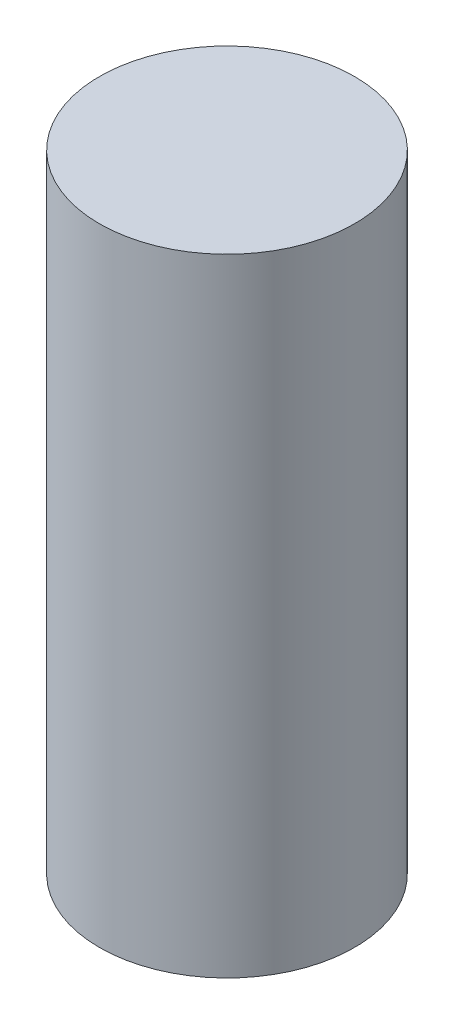
ISO-10303-21;
HEADER;
FILE_DESCRIPTION(('STEP AP214'),'2;1');
FILE_NAME('part.step','',(''),(''),'','','');
FILE_SCHEMA(('AUTOMOTIVE_DESIGN { 1 0 10303 214 1 1 1 1 }'));
ENDSEC;
DATA;
#1=APPLICATION_CONTEXT('core data for automotive mechanical design processes');
#2=APPLICATION_PROTOCOL_DEFINITION('international standard','automotive_design',2000,#1);
#3=PRODUCT_CONTEXT('',#1,'mechanical');
#4=PRODUCT('Part','Part','',(#3));
#5=PRODUCT_RELATED_PRODUCT_CATEGORY('part','',(#4));
#6=PRODUCT_DEFINITION_FORMATION('','',#4);
#7=PRODUCT_DEFINITION_CONTEXT('part definition',#1,'design');
#8=PRODUCT_DEFINITION('design','',#6,#7);
#9=PRODUCT_DEFINITION_SHAPE('','',#8);
#10=(LENGTH_UNIT() NAMED_UNIT(*) SI_UNIT(.MILLI.,.METRE.));
#11=(NAMED_UNIT(*) PLANE_ANGLE_UNIT() SI_UNIT($,.RADIAN.));
#12=(NAMED_UNIT(*) SI_UNIT($,.STERADIAN.) SOLID_ANGLE_UNIT());
#13=UNCERTAINTY_MEASURE_WITH_UNIT(LENGTH_MEASURE(1.E-05),#10,'distance_accuracy_value','');
#14=(GEOMETRIC_REPRESENTATION_CONTEXT(3) GLOBAL_UNCERTAINTY_ASSIGNED_CONTEXT((#13)) GLOBAL_UNIT_ASSIGNED_CONTEXT((#10,
#11,#12)) REPRESENTATION_CONTEXT('',''));
#15=CARTESIAN_POINT('',(0.,0.,0.));
#16=DIRECTION('',(0.,0.,1.));
#17=DIRECTION('',(1.,0.,0.));
#18=AXIS2_PLACEMENT_3D('',#15,#16,#17);
#19=CARTESIAN_POINT('',(-20.4825887636145,12.2364464109381,79.5198251851226));
#20=DIRECTION('',(0.,-1.,0.));
#21=DIRECTION('',(-0.0616130136495363,0.,-0.998100113490136));
#22=AXIS2_PLACEMENT_3D('',#19,#20,#21);
#23=PLANE('',#22);
#24=CARTESIAN_POINT('',(0.,12.2364464109381,0.));
#25=DIRECTION('',(0.,-1.,0.));
#26=DIRECTION('',(0.,0.,-1.));
#27=AXIS2_PLACEMENT_3D('',#24,#25,#26);
#28=CIRCLE('',#27,6.35);
#29=CARTESIAN_POINT('',(0.,12.2364464109381,-6.35));
#30=VERTEX_POINT('',#29);
#31=EDGE_CURVE('E10',#30,#30,#28,.T.);
#32=ORIENTED_EDGE('',*,*,#31,.F.);
#33=EDGE_LOOP('',(#32));
#34=FACE_BOUND('',#33,.T.);
#35=ADVANCED_FACE('F31',(#34),#23,.F.);
#36=CARTESIAN_POINT('',(0.,30.1969586530764,0.));
#37=DIRECTION('',(0.,-1.,0.));
#38=DIRECTION('',(0.,0.,-1.));
#39=AXIS2_PLACEMENT_3D('',#36,#37,#38);
#40=CYLINDRICAL_SURFACE('',#39,6.35);
#41=CARTESIAN_POINT('',(0.,-18.9635535890619,0.));
#42=DIRECTION('',(0.,-1.,0.));
#43=DIRECTION('',(0.,0.,-1.));
#44=AXIS2_PLACEMENT_3D('',#41,#42,#43);
#45=CIRCLE('',#44,6.35);
#46=CARTESIAN_POINT('',(0.,-18.9635535890619,-6.35));
#47=VERTEX_POINT('',#46);
#48=EDGE_CURVE('E37',#47,#47,#45,.F.);
#49=CARTESIAN_POINT('',(0.,12.2364464109381,-6.35));
#50=CARTESIAN_POINT('',(0.,11.9114464109381,-6.35));
#51=CARTESIAN_POINT('',(0.,11.5864464109381,-6.35));
#52=CARTESIAN_POINT('',(0.,10.9364464109381,-6.35));
#53=CARTESIAN_POINT('',(0.,10.6114464109381,-6.35));
#54=CARTESIAN_POINT('',(0.,9.96144641093806,-6.35));
#55=CARTESIAN_POINT('',(0.,9.63644641093807,-6.35));
#56=CARTESIAN_POINT('',(0.,8.98644641093806,-6.35));
#57=CARTESIAN_POINT('',(0.,8.66144641093807,-6.35));
#58=CARTESIAN_POINT('',(0.,8.01144641093807,-6.35));
#59=CARTESIAN_POINT('',(0.,7.68644641093807,-6.35));
#60=CARTESIAN_POINT('',(0.,7.03644641093807,-6.35));
#61=CARTESIAN_POINT('',(0.,6.71144641093807,-6.35));
#62=CARTESIAN_POINT('',(0.,6.06144641093807,-6.35));
#63=CARTESIAN_POINT('',(0.,5.73644641093807,-6.35));
#64=CARTESIAN_POINT('',(0.,5.08644641093807,-6.35));
#65=CARTESIAN_POINT('',(0.,4.76144641093807,-6.35));
#66=CARTESIAN_POINT('',(0.,4.11144641093807,-6.35));
#67=CARTESIAN_POINT('',(0.,3.78644641093807,-6.35));
#68=CARTESIAN_POINT('',(0.,3.13644641093807,-6.35));
#69=CARTESIAN_POINT('',(0.,2.81144641093807,-6.35));
#70=CARTESIAN_POINT('',(0.,2.16144641093807,-6.35));
#71=CARTESIAN_POINT('',(0.,1.83644641093807,-6.35));
#72=CARTESIAN_POINT('',(0.,1.18644641093807,-6.35));
#73=CARTESIAN_POINT('',(0.,0.861446410938074,-6.35));
#74=CARTESIAN_POINT('',(0.,0.211446410938075,-6.35));
#75=CARTESIAN_POINT('',(0.,-0.113553589061925,-6.35));
#76=CARTESIAN_POINT('',(0.,-0.763553589061924,-6.35));
#77=CARTESIAN_POINT('',(0.,-1.08855358906192,-6.35));
#78=CARTESIAN_POINT('',(0.,-1.73855358906192,-6.35));
#79=CARTESIAN_POINT('',(0.,-2.06355358906192,-6.35));
#80=CARTESIAN_POINT('',(0.,-2.71355358906192,-6.35));
#81=CARTESIAN_POINT('',(0.,-3.03855358906192,-6.35));
#82=CARTESIAN_POINT('',(0.,-3.68855358906192,-6.35));
#83=CARTESIAN_POINT('',(0.,-4.01355358906192,-6.35));
#84=CARTESIAN_POINT('',(0.,-4.66355358906192,-6.35));
#85=CARTESIAN_POINT('',(0.,-4.98855358906192,-6.35));
#86=CARTESIAN_POINT('',(0.,-5.63855358906191,-6.35));
#87=CARTESIAN_POINT('',(0.,-5.96355358906191,-6.35));
#88=CARTESIAN_POINT('',(0.,-6.61355358906191,-6.35));
#89=CARTESIAN_POINT('',(0.,-6.93855358906191,-6.35));
#90=CARTESIAN_POINT('',(0.,-7.58855358906191,-6.35));
#91=CARTESIAN_POINT('',(0.,-7.91355358906191,-6.35));
#92=CARTESIAN_POINT('',(0.,-8.56355358906191,-6.35));
#93=CARTESIAN_POINT('',(0.,-8.88855358906191,-6.35));
#94=CARTESIAN_POINT('',(0.,-9.53855358906191,-6.35));
#95=CARTESIAN_POINT('',(0.,-9.86355358906191,-6.35));
#96=CARTESIAN_POINT('',(0.,-10.5135535890619,-6.35));
#97=CARTESIAN_POINT('',(0.,-10.8385535890619,-6.35));
#98=CARTESIAN_POINT('',(0.,-11.4885535890619,-6.35));
#99=CARTESIAN_POINT('',(0.,-11.8135535890619,-6.35));
#100=CARTESIAN_POINT('',(0.,-12.4635535890619,-6.35));
#101=CARTESIAN_POINT('',(0.,-12.7885535890619,-6.35));
#102=CARTESIAN_POINT('',(0.,-13.4385535890619,-6.35));
#103=CARTESIAN_POINT('',(0.,-13.7635535890619,-6.35));
#104=CARTESIAN_POINT('',(0.,-14.4135535890619,-6.35));
#105=CARTESIAN_POINT('',(0.,-14.7385535890619,-6.35));
#106=CARTESIAN_POINT('',(0.,-15.3885535890619,-6.35));
#107=CARTESIAN_POINT('',(0.,-15.7135535890619,-6.35));
#108=CARTESIAN_POINT('',(0.,-16.3635535890619,-6.35));
#109=CARTESIAN_POINT('',(0.,-16.6885535890619,-6.35));
#110=CARTESIAN_POINT('',(0.,-17.3385535890619,-6.35));
#111=CARTESIAN_POINT('',(0.,-17.6635535890619,-6.35));
#112=CARTESIAN_POINT('',(0.,-18.3135535890619,-6.35));
#113=CARTESIAN_POINT('',(0.,-18.6385535890619,-6.35));
#114=CARTESIAN_POINT('',(0.,-18.9635535890619,-6.35));
#115=B_SPLINE_CURVE_WITH_KNOTS('',3,(#49,#50,#51,#52,#53,#54,#55,#56,#57,#58,#59,#60,#61,#62,
#63,#64,#65,#66,#67,#68,#69,#70,#71,#72,#73,#74,#75,#76,#77,#78,#79,#80,#81,#82,#83,#84,#85,#86,
#87,#88,#89,#90,#91,#92,#93,#94,#95,#96,#97,#98,#99,#100,#101,#102,#103,#104,#105,#106,#107,
#108,#109,#110,#111,#112,#113,#114),.UNSPECIFIED.,.F.,.F.,(4,2,2,2,2,2,2,2,2,2,2,2,2,2,2,2,2,2,
2,2,2,2,2,2,2,2,2,2,2,2,2,2,4),(0.,0.975,1.95,2.925,3.9,4.875,5.84999999999999,6.82499999999999,
7.79999999999999,8.77499999999999,9.74999999999999,10.725,11.7,12.675,13.65,14.625,15.6,16.575,
17.55,18.525,19.5,20.475,21.45,22.425,23.4,24.375,25.35,26.325,27.3,28.275,29.25,30.225,31.2),.UNSPECIFIED.);
#116=EDGE_CURVE('BSEAM43',#30,#47,#115,.T.);
#117=ORIENTED_EDGE('',*,*,#31,.T.);
#118=ORIENTED_EDGE('',*,*,#48,.T.);
#119=ORIENTED_EDGE('',*,*,#116,.T.);
#120=ORIENTED_EDGE('',*,*,#116,.F.);
#121=EDGE_LOOP('',(#117,#119,#118,#120));
#122=FACE_BOUND('',#121,.T.);
#123=ADVANCED_FACE('F43',(#122),#40,.T.);
#124=CARTESIAN_POINT('',(-30.623245819825,-18.9635535890619,83.3030324511727));
#125=DIRECTION('',(0.,-1.,0.));
#126=DIRECTION('',(-0.0616130136495002,0.,-0.998100113490138));
#127=AXIS2_PLACEMENT_3D('',#124,#125,#126);
#128=PLANE('',#127);
#129=ORIENTED_EDGE('',*,*,#48,.F.);
#130=EDGE_LOOP('',(#129));
#131=FACE_BOUND('',#130,.T.);
#132=ADVANCED_FACE('F45',(#131),#128,.T.);
#133=CLOSED_SHELL('',(#35,#123,#132));
#134=MANIFOLD_SOLID_BREP('B2',#133);
#135=ADVANCED_BREP_SHAPE_REPRESENTATION('',(#18,#134),#14);
#136=SHAPE_DEFINITION_REPRESENTATION(#9,#135);
ENDSEC;
END-ISO-10303-21;
